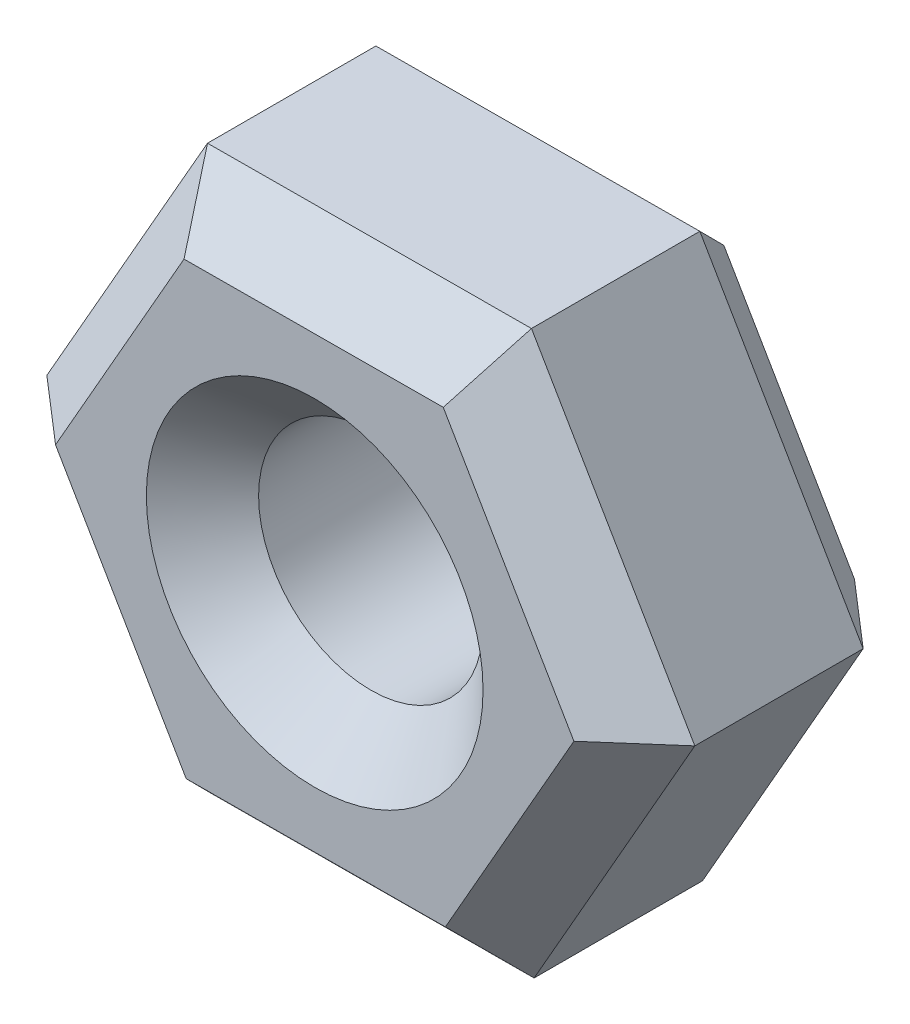
ISO-10303-21;
HEADER;
FILE_DESCRIPTION(('STEP AP214'),'2;1');
FILE_NAME('part.step','',(''),(''),'','','');
FILE_SCHEMA(('AUTOMOTIVE_DESIGN { 1 0 10303 214 1 1 1 1 }'));
ENDSEC;
DATA;
#1=APPLICATION_CONTEXT('core data for automotive mechanical design processes');
#2=APPLICATION_PROTOCOL_DEFINITION('international standard','automotive_design',2000,#1);
#3=PRODUCT_CONTEXT('',#1,'mechanical');
#4=PRODUCT('Part','Part','',(#3));
#5=PRODUCT_RELATED_PRODUCT_CATEGORY('part','',(#4));
#6=PRODUCT_DEFINITION_FORMATION('','',#4);
#7=PRODUCT_DEFINITION_CONTEXT('part definition',#1,'design');
#8=PRODUCT_DEFINITION('design','',#6,#7);
#9=PRODUCT_DEFINITION_SHAPE('','',#8);
#10=(LENGTH_UNIT() NAMED_UNIT(*) SI_UNIT(.MILLI.,.METRE.));
#11=(NAMED_UNIT(*) PLANE_ANGLE_UNIT() SI_UNIT($,.RADIAN.));
#12=(NAMED_UNIT(*) SI_UNIT($,.STERADIAN.) SOLID_ANGLE_UNIT());
#13=UNCERTAINTY_MEASURE_WITH_UNIT(LENGTH_MEASURE(1.E-05),#10,'distance_accuracy_value','');
#14=(GEOMETRIC_REPRESENTATION_CONTEXT(3) GLOBAL_UNCERTAINTY_ASSIGNED_CONTEXT((#13)) GLOBAL_UNIT_ASSIGNED_CONTEXT((#10,
#11,#12)) REPRESENTATION_CONTEXT('',''));
#15=CARTESIAN_POINT('',(0.,0.,0.));
#16=DIRECTION('',(0.,0.,1.));
#17=DIRECTION('',(1.,0.,0.));
#18=AXIS2_PLACEMENT_3D('',#15,#16,#17);
#19=CARTESIAN_POINT('',(0.,0.,5.));
#20=DIRECTION('',(0.,0.,1.));
#21=DIRECTION('',(1.,0.,0.));
#22=AXIS2_PLACEMENT_3D('',#19,#20,#21);
#23=PLANE('',#22);
#24=CARTESIAN_POINT('',(-36.0675441717207,11.9500899364135,5.));
#25=DIRECTION('',(0.,0.,1.));
#26=DIRECTION('',(1.,0.,0.));
#27=AXIS2_PLACEMENT_3D('',#24,#25,#26);
#28=CIRCLE('',#27,3.);
#29=CARTESIAN_POINT('',(-33.0675441717207,11.9500899364135,5.));
#30=VERTEX_POINT('',#29);
#31=EDGE_CURVE('E166',#30,#30,#28,.F.);
#32=ORIENTED_EDGE('',*,*,#31,.T.);
#33=EDGE_LOOP('',(#32));
#34=FACE_BOUND('',#33,.T.);
#35=DIRECTION('',(0.99998873127296,0.00474734948108524,0.));
#36=VECTOR('',#35,1.);
#37=CARTESIAN_POINT('',(-33.1618359578612,7.96383942882583,5.));
#38=LINE('',#37,#36);
#39=CARTESIAN_POINT('',(-38.3579298265445,7.93917147731825,5.));
#40=VERTEX_POINT('',#39);
#41=CARTESIAN_POINT('',(-33.7391797210482,7.96109854532499,5.));
#42=VERTEX_POINT('',#41);
#43=EDGE_CURVE('E163',#40,#42,#38,.T.);
#44=ORIENTED_EDGE('',*,*,#43,.T.);
#45=DIRECTION('',(0.495883040385217,0.868389319521097,0.));
#46=VECTOR('',#45,1.);
#47=CARTESIAN_POINT('',(-31.1624958593714,12.4733818118071,5.));
#48=LINE('',#47,#46);
#49=CARTESIAN_POINT('',(-31.4487940662244,11.9720170044202,5.));
#50=VERTEX_POINT('',#49);
#51=EDGE_CURVE('E143',#42,#50,#48,.T.);
#52=ORIENTED_EDGE('',*,*,#51,.T.);
#53=DIRECTION('',(-0.504105690887743,0.863641970040011,0.));
#54=VECTOR('',#53,1.);
#55=CARTESIAN_POINT('',(-34.068204073231,16.4596323193947,5.));
#56=LINE('',#55,#54);
#57=CARTESIAN_POINT('',(-33.7771585168969,15.9610083955087,5.));
#58=VERTEX_POINT('',#57);
#59=EDGE_CURVE('E152',#50,#58,#56,.T.);
#60=ORIENTED_EDGE('',*,*,#59,.T.);
#61=DIRECTION('',(-0.99998873127296,-0.00474734948108554,0.));
#62=VECTOR('',#61,1.);
#63=CARTESIAN_POINT('',(-38.9732523855802,15.9363404440011,5.));
#64=LINE('',#63,#62);
#65=CARTESIAN_POINT('',(-38.3959086223932,15.9390813275019,5.));
#66=VERTEX_POINT('',#65);
#67=EDGE_CURVE('E159',#58,#66,#64,.T.);
#68=ORIENTED_EDGE('',*,*,#67,.T.);
#69=DIRECTION('',(-0.495883040385216,-0.868389319521097,0.));
#70=VECTOR('',#69,1.);
#71=CARTESIAN_POINT('',(-40.97259248407,11.4267980610198,5.));
#72=LINE('',#71,#70);
#73=CARTESIAN_POINT('',(-40.686294277217,11.9281628684067,5.));
#74=VERTEX_POINT('',#73);
#75=EDGE_CURVE('E310',#66,#74,#72,.T.);
#76=ORIENTED_EDGE('',*,*,#75,.T.);
#77=DIRECTION('',(0.504105690887743,-0.863641970040011,0.));
#78=VECTOR('',#77,1.);
#79=CARTESIAN_POINT('',(-38.0668842702104,7.44054755343219,5.));
#80=LINE('',#79,#78);
#81=EDGE_CURVE('E173',#74,#40,#80,.T.);
#82=ORIENTED_EDGE('',*,*,#81,.T.);
#83=EDGE_LOOP('',(#44,#52,#60,#68,#76,#82));
#84=FACE_BOUND('',#83,.T.);
#85=ADVANCED_FACE('F45',(#34,#84),#23,.T.);
#86=CARTESIAN_POINT('',(0.,0.,0.));
#87=DIRECTION('',(0.,0.,1.));
#88=DIRECTION('',(1.,0.,0.));
#89=AXIS2_PLACEMENT_3D('',#86,#87,#88);
#90=PLANE('',#89);
#91=CARTESIAN_POINT('',(-36.0675441717207,11.9500899364135,0.));
#92=DIRECTION('',(0.,0.,1.));
#93=DIRECTION('',(1.,0.,0.));
#94=AXIS2_PLACEMENT_3D('',#91,#92,#93);
#95=CIRCLE('',#94,3.);
#96=CARTESIAN_POINT('',(-33.0675441717207,11.9500899364135,0.));
#97=VERTEX_POINT('',#96);
#98=EDGE_CURVE('E11',#97,#97,#95,.T.);
#99=ORIENTED_EDGE('',*,*,#98,.T.);
#100=EDGE_LOOP('',(#99));
#101=FACE_BOUND('',#100,.T.);
#102=DIRECTION('',(0.495883040385216,0.868389319521097,0.));
#103=VECTOR('',#102,1.);
#104=CARTESIAN_POINT('',(-35.8180348915737,20.4534482902813,0.));
#105=LINE('',#104,#103);
#106=CARTESIAN_POINT('',(-40.686294277217,11.9281628684067,0.));
#107=VERTEX_POINT('',#106);
#108=CARTESIAN_POINT('',(-38.3959086223932,15.9390813275019,0.));
#109=VERTEX_POINT('',#108);
#110=EDGE_CURVE('E64',#107,#109,#105,.T.);
#111=ORIENTED_EDGE('',*,*,#110,.T.);
#112=DIRECTION('',(0.99998873127296,0.00474734948108554,0.));
#113=VECTOR('',#112,1.);
#114=CARTESIAN_POINT('',(-0.0765328779344243,16.1209988460368,0.));
#115=LINE('',#114,#113);
#116=CARTESIAN_POINT('',(-33.7771585168969,15.9610083955087,0.));
#117=VERTEX_POINT('',#116);
#118=EDGE_CURVE('E56',#109,#117,#115,.T.);
#119=ORIENTED_EDGE('',*,*,#118,.T.);
#120=DIRECTION('',(0.504105690887743,-0.863641970040011,0.));
#121=VECTOR('',#120,1.);
#122=CARTESIAN_POINT('',(-18.2447272839216,-10.6494023815143,0.));
#123=LINE('',#122,#121);
#124=CARTESIAN_POINT('',(-31.4487940662244,11.9720170044202,0.));
#125=VERTEX_POINT('',#124);
#126=EDGE_CURVE('E212',#117,#125,#123,.T.);
#127=ORIENTED_EDGE('',*,*,#126,.T.);
#128=DIRECTION('',(-0.495883040385217,-0.868389319521097,0.));
#129=VECTOR('',#128,1.);
#130=CARTESIAN_POINT('',(-28.8709203354049,16.4863839671996,0.));
#131=LINE('',#130,#129);
#132=CARTESIAN_POINT('',(-33.7391797210482,7.96109854532498,0.));
#133=VERTEX_POINT('',#132);
#134=EDGE_CURVE('E215',#125,#133,#131,.T.);
#135=ORIENTED_EDGE('',*,*,#134,.T.);
#136=DIRECTION('',(-0.99998873127296,-0.00474734948108524,0.));
#137=VECTOR('',#136,1.);
#138=CARTESIAN_POINT('',(-0.0385540820857374,8.12108899585307,0.));
#139=LINE('',#138,#137);
#140=CARTESIAN_POINT('',(-38.3579298265445,7.93917147731825,0.));
#141=VERTEX_POINT('',#140);
#142=EDGE_CURVE('E218',#133,#141,#139,.T.);
#143=ORIENTED_EDGE('',*,*,#142,.T.);
#144=DIRECTION('',(-0.504105690887743,0.863641970040011,0.));
#145=VECTOR('',#144,1.);
#146=CARTESIAN_POINT('',(-25.1538630442417,-14.6822479086162,0.));
#147=LINE('',#146,#145);
#148=EDGE_CURVE('E69',#141,#107,#147,.T.);
#149=ORIENTED_EDGE('',*,*,#148,.T.);
#150=EDGE_LOOP('',(#111,#119,#127,#135,#143,#149));
#151=FACE_BOUND('',#150,.T.);
#152=ADVANCED_FACE('F274',(#101,#151),#90,.F.);
#153=CARTESIAN_POINT('',(-30.2941065398503,11.9774987714219,5.));
#154=DIRECTION('',(-0.863641970040011,-0.504105690887743,0.));
#155=DIRECTION('',(0.504105690887743,-0.863641970040011,0.));
#156=AXIS2_PLACEMENT_3D('',#153,#154,#155);
#157=PLANE('',#156);
#158=DIRECTION('',(0.,0.,-1.));
#159=VECTOR('',#158,1.);
#160=CARTESIAN_POINT('',(-33.204562103191,16.9637380102825,5.));
#161=LINE('',#160,#159);
#162=CARTESIAN_POINT('',(-33.204562103191,16.9637380102825,4.));
#163=VERTEX_POINT('',#162);
#164=CARTESIAN_POINT('',(-33.204562103191,16.9637380102825,0.999999999999999));
#165=VERTEX_POINT('',#164);
#166=EDGE_CURVE('E286',#163,#165,#161,.T.);
#167=ORIENTED_EDGE('',*,*,#166,.F.);
#168=DIRECTION('',(0.504105690887743,-0.863641970040011,0.));
#169=VECTOR('',#168,1.);
#170=CARTESIAN_POINT('',(-30.2941065398503,11.9774987714219,4.));
#171=LINE('',#170,#169);
#172=CARTESIAN_POINT('',(-30.2941065398503,11.9774987714219,4.));
#173=VERTEX_POINT('',#172);
#174=EDGE_CURVE('E209',#163,#173,#171,.T.);
#175=ORIENTED_EDGE('',*,*,#174,.T.);
#176=DIRECTION('',(0.,0.,-1.));
#177=VECTOR('',#176,1.);
#178=CARTESIAN_POINT('',(-30.2941065398503,11.9774987714219,5.));
#179=LINE('',#178,#177);
#180=CARTESIAN_POINT('',(-30.2941065398503,11.9774987714219,0.999999999999999));
#181=VERTEX_POINT('',#180);
#182=EDGE_CURVE('E243',#173,#181,#179,.T.);
#183=ORIENTED_EDGE('',*,*,#182,.T.);
#184=DIRECTION('',(-0.504105690887743,0.863641970040011,0.));
#185=VECTOR('',#184,1.);
#186=CARTESIAN_POINT('',(-30.2941065398503,11.9774987714219,0.999999999999999));
#187=LINE('',#186,#185);
#188=EDGE_CURVE('E206',#181,#165,#187,.T.);
#189=ORIENTED_EDGE('',*,*,#188,.T.);
#190=EDGE_LOOP('',(#167,#175,#183,#189));
#191=FACE_BOUND('',#190,.T.);
#192=ADVANCED_FACE('F285',(#191),#157,.F.);
#193=CARTESIAN_POINT('',(-33.204562103191,16.9637380102825,5.));
#194=DIRECTION('',(0.00474734948108554,-0.99998873127296,0.));
#195=DIRECTION('',(0.99998873127296,0.00474734948108554,0.));
#196=AXIS2_PLACEMENT_3D('',#193,#194,#195);
#197=PLANE('',#196);
#198=DIRECTION('',(0.,0.,-1.));
#199=VECTOR('',#198,1.);
#200=CARTESIAN_POINT('',(-38.9779997350613,16.9363291752741,5.));
#201=LINE('',#200,#199);
#202=CARTESIAN_POINT('',(-38.9779997350613,16.9363291752741,4.));
#203=VERTEX_POINT('',#202);
#204=CARTESIAN_POINT('',(-38.9779997350613,16.9363291752741,0.999999999999999));
#205=VERTEX_POINT('',#204);
#206=EDGE_CURVE('E295',#203,#205,#201,.T.);
#207=ORIENTED_EDGE('',*,*,#206,.F.);
#208=DIRECTION('',(0.99998873127296,0.00474734948108554,0.));
#209=VECTOR('',#208,1.);
#210=CARTESIAN_POINT('',(-33.204562103191,16.9637380102825,4.));
#211=LINE('',#210,#209);
#212=EDGE_CURVE('E203',#203,#163,#211,.T.);
#213=ORIENTED_EDGE('',*,*,#212,.T.);
#214=ORIENTED_EDGE('',*,*,#166,.T.);
#215=DIRECTION('',(-0.99998873127296,-0.00474734948108554,0.));
#216=VECTOR('',#215,1.);
#217=CARTESIAN_POINT('',(-33.204562103191,16.9637380102825,0.999999999999999));
#218=LINE('',#217,#216);
#219=EDGE_CURVE('E199',#165,#205,#218,.T.);
#220=ORIENTED_EDGE('',*,*,#219,.T.);
#221=EDGE_LOOP('',(#207,#213,#214,#220));
#222=FACE_BOUND('',#221,.T.);
#223=ADVANCED_FACE('F290',(#222),#197,.F.);
#224=CARTESIAN_POINT('',(-38.9779997350613,16.9363291752741,5.));
#225=DIRECTION('',(0.868389319521097,-0.495883040385216,0.));
#226=DIRECTION('',(0.495883040385216,0.868389319521097,0.));
#227=AXIS2_PLACEMENT_3D('',#224,#225,#226);
#228=PLANE('',#227);
#229=DIRECTION('',(0.,0.,-1.));
#230=VECTOR('',#229,1.);
#231=CARTESIAN_POINT('',(-41.8409818035911,11.922681101405,5.));
#232=LINE('',#231,#230);
#233=CARTESIAN_POINT('',(-41.8409818035911,11.922681101405,4.));
#234=VERTEX_POINT('',#233);
#235=CARTESIAN_POINT('',(-41.8409818035911,11.922681101405,0.999999999999999));
#236=VERTEX_POINT('',#235);
#237=EDGE_CURVE('E301',#234,#236,#232,.T.);
#238=ORIENTED_EDGE('',*,*,#237,.F.);
#239=DIRECTION('',(0.495883040385216,0.868389319521097,0.));
#240=VECTOR('',#239,1.);
#241=CARTESIAN_POINT('',(-38.9779997350613,16.9363291752741,4.));
#242=LINE('',#241,#240);
#243=EDGE_CURVE('E196',#234,#203,#242,.T.);
#244=ORIENTED_EDGE('',*,*,#243,.T.);
#245=ORIENTED_EDGE('',*,*,#206,.T.);
#246=DIRECTION('',(-0.495883040385216,-0.868389319521097,0.));
#247=VECTOR('',#246,1.);
#248=CARTESIAN_POINT('',(-38.9779997350613,16.9363291752741,0.999999999999999));
#249=LINE('',#248,#247);
#250=EDGE_CURVE('E193',#205,#236,#249,.T.);
#251=ORIENTED_EDGE('',*,*,#250,.T.);
#252=EDGE_LOOP('',(#238,#244,#245,#251));
#253=FACE_BOUND('',#252,.T.);
#254=ADVANCED_FACE('F378',(#253),#228,.F.);
#255=CARTESIAN_POINT('',(-41.8409818035911,11.922681101405,5.));
#256=DIRECTION('',(0.863641970040011,0.504105690887743,0.));
#257=DIRECTION('',(-0.504105690887743,0.863641970040011,0.));
#258=AXIS2_PLACEMENT_3D('',#255,#256,#257);
#259=PLANE('',#258);
#260=DIRECTION('',(0.,0.,-1.));
#261=VECTOR('',#260,1.);
#262=CARTESIAN_POINT('',(-38.9305262402504,6.93644186254445,5.));
#263=LINE('',#262,#261);
#264=CARTESIAN_POINT('',(-38.9305262402504,6.93644186254445,4.));
#265=VERTEX_POINT('',#264);
#266=CARTESIAN_POINT('',(-38.9305262402504,6.93644186254445,0.999999999999999));
#267=VERTEX_POINT('',#266);
#268=EDGE_CURVE('E333',#265,#267,#263,.T.);
#269=ORIENTED_EDGE('',*,*,#268,.F.);
#270=DIRECTION('',(-0.504105690887743,0.863641970040011,0.));
#271=VECTOR('',#270,1.);
#272=CARTESIAN_POINT('',(-41.8409818035911,11.922681101405,4.));
#273=LINE('',#272,#271);
#274=EDGE_CURVE('E190',#265,#234,#273,.T.);
#275=ORIENTED_EDGE('',*,*,#274,.T.);
#276=ORIENTED_EDGE('',*,*,#237,.T.);
#277=DIRECTION('',(0.504105690887743,-0.863641970040011,0.));
#278=VECTOR('',#277,1.);
#279=CARTESIAN_POINT('',(-41.8409818035911,11.922681101405,0.999999999999999));
#280=LINE('',#279,#278);
#281=EDGE_CURVE('E187',#236,#267,#280,.T.);
#282=ORIENTED_EDGE('',*,*,#281,.T.);
#283=EDGE_LOOP('',(#269,#275,#276,#282));
#284=FACE_BOUND('',#283,.T.);
#285=ADVANCED_FACE('F343',(#284),#259,.F.);
#286=CARTESIAN_POINT('',(-38.9305262402504,6.93644186254445,5.));
#287=DIRECTION('',(-0.00474734948108524,0.99998873127296,0.));
#288=DIRECTION('',(-0.99998873127296,-0.00474734948108524,0.));
#289=AXIS2_PLACEMENT_3D('',#286,#287,#288);
#290=PLANE('',#289);
#291=DIRECTION('',(0.,0.,-1.));
#292=VECTOR('',#291,1.);
#293=CARTESIAN_POINT('',(-33.1570886083801,6.96385069755287,5.));
#294=LINE('',#293,#292);
#295=CARTESIAN_POINT('',(-33.1570886083801,6.96385069755287,4.));
#296=VERTEX_POINT('',#295);
#297=CARTESIAN_POINT('',(-33.1570886083801,6.96385069755287,0.999999999999999));
#298=VERTEX_POINT('',#297);
#299=EDGE_CURVE('E330',#296,#298,#294,.T.);
#300=ORIENTED_EDGE('',*,*,#299,.F.);
#301=DIRECTION('',(-0.99998873127296,-0.00474734948108524,0.));
#302=VECTOR('',#301,1.);
#303=CARTESIAN_POINT('',(-38.9305262402504,6.93644186254445,4.));
#304=LINE('',#303,#302);
#305=EDGE_CURVE('E184',#296,#265,#304,.T.);
#306=ORIENTED_EDGE('',*,*,#305,.T.);
#307=ORIENTED_EDGE('',*,*,#268,.T.);
#308=DIRECTION('',(0.99998873127296,0.00474734948108524,0.));
#309=VECTOR('',#308,1.);
#310=CARTESIAN_POINT('',(-38.9305262402504,6.93644186254445,0.999999999999999));
#311=LINE('',#310,#309);
#312=EDGE_CURVE('E181',#267,#298,#311,.T.);
#313=ORIENTED_EDGE('',*,*,#312,.T.);
#314=EDGE_LOOP('',(#300,#306,#307,#313));
#315=FACE_BOUND('',#314,.T.);
#316=ADVANCED_FACE('F331',(#315),#290,.F.);
#317=CARTESIAN_POINT('',(-33.1570886083801,6.96385069755287,5.));
#318=DIRECTION('',(-0.868389319521097,0.495883040385217,0.));
#319=DIRECTION('',(-0.495883040385217,-0.868389319521097,0.));
#320=AXIS2_PLACEMENT_3D('',#317,#318,#319);
#321=PLANE('',#320);
#322=ORIENTED_EDGE('',*,*,#182,.F.);
#323=DIRECTION('',(-0.495883040385217,-0.868389319521097,0.));
#324=VECTOR('',#323,1.);
#325=CARTESIAN_POINT('',(-33.1570886083801,6.96385069755287,4.));
#326=LINE('',#325,#324);
#327=EDGE_CURVE('E145',#173,#296,#326,.T.);
#328=ORIENTED_EDGE('',*,*,#327,.T.);
#329=ORIENTED_EDGE('',*,*,#299,.T.);
#330=DIRECTION('',(0.495883040385217,0.868389319521097,0.));
#331=VECTOR('',#330,1.);
#332=CARTESIAN_POINT('',(-33.1570886083801,6.96385069755287,0.999999999999999));
#333=LINE('',#332,#331);
#334=EDGE_CURVE('E171',#298,#181,#333,.T.);
#335=ORIENTED_EDGE('',*,*,#334,.T.);
#336=EDGE_LOOP('',(#322,#328,#329,#335));
#337=FACE_BOUND('',#336,.T.);
#338=ADVANCED_FACE('F329',(#337),#321,.F.);
#339=CARTESIAN_POINT('',(-36.0675441717207,11.9500899364135,5.));
#340=DIRECTION('',(0.,0.,-1.));
#341=DIRECTION('',(-1.,0.,0.));
#342=AXIS2_PLACEMENT_3D('',#339,#340,#341);
#343=CYLINDRICAL_SURFACE('',#342,2.);
#344=CARTESIAN_POINT('',(-36.0675441717207,11.9500899364135,4.));
#345=DIRECTION('',(0.,0.,1.));
#346=DIRECTION('',(1.,0.,0.));
#347=AXIS2_PLACEMENT_3D('',#344,#345,#346);
#348=CIRCLE('',#347,2.);
#349=CARTESIAN_POINT('',(-34.0675441717207,11.9500899364135,4.));
#350=VERTEX_POINT('',#349);
#351=EDGE_CURVE('E160',#350,#350,#348,.T.);
#352=ORIENTED_EDGE('',*,*,#351,.T.);
#353=EDGE_LOOP('',(#352));
#354=FACE_BOUND('',#353,.T.);
#355=CARTESIAN_POINT('',(-36.0675441717207,11.9500899364135,1.));
#356=DIRECTION('',(0.,0.,1.));
#357=DIRECTION('',(1.,0.,0.));
#358=AXIS2_PLACEMENT_3D('',#355,#356,#357);
#359=CIRCLE('',#358,2.);
#360=CARTESIAN_POINT('',(-34.0675441717207,11.9500899364135,1.));
#361=VERTEX_POINT('',#360);
#362=EDGE_CURVE('E294',#361,#361,#359,.F.);
#363=ORIENTED_EDGE('',*,*,#362,.T.);
#364=EDGE_LOOP('',(#363));
#365=FACE_BOUND('',#364,.T.);
#366=ADVANCED_FACE('F370',(#354,#365),#343,.F.);
#367=CARTESIAN_POINT('',(-36.0675441717207,11.9500899364135,4.));
#368=DIRECTION('',(0.,0.,1.));
#369=DIRECTION('',(1.,0.,0.));
#370=AXIS2_PLACEMENT_3D('',#367,#368,#369);
#371=CONICAL_SURFACE('',#370,2.,0.78539816339745);
#372=ORIENTED_EDGE('',*,*,#31,.F.);
#373=EDGE_LOOP('',(#372));
#374=FACE_BOUND('',#373,.T.);
#375=ORIENTED_EDGE('',*,*,#351,.F.);
#376=EDGE_LOOP('',(#375));
#377=FACE_BOUND('',#376,.T.);
#378=ADVANCED_FACE('F386',(#374,#377),#371,.F.);
#379=CARTESIAN_POINT('',(-35.8180348915737,20.4534482902813,5.));
#380=DIRECTION('',(-0.614043976543338,0.350642260531789,0.707106781186548));
#381=DIRECTION('',(0.495883040385216,0.868389319521097,0.));
#382=AXIS2_PLACEMENT_3D('',#379,#380,#381);
#383=PLANE('',#382);
#384=DIRECTION('',(0.38106808359468,-0.652851964149645,0.654653670707977));
#385=VECTOR('',#384,1.);
#386=CARTESIAN_POINT('',(-32.8766991753434,6.48348301533186,14.4816933757182));
#387=LINE('',#386,#385);
#388=EDGE_CURVE('E235',#203,#66,#387,.T.);
#389=ORIENTED_EDGE('',*,*,#388,.F.);
#390=ORIENTED_EDGE('',*,*,#243,.F.);
#391=DIRECTION('',(0.755920427661501,0.00358865888961803,0.654653670707976));
#392=VECTOR('',#391,1.);
#393=CARTESIAN_POINT('',(-37.8813675793089,11.9414789857662,7.42916514974057));
#394=LINE('',#393,#392);
#395=EDGE_CURVE('E239',#74,#234,#394,.F.);
#396=ORIENTED_EDGE('',*,*,#395,.F.);
#397=ORIENTED_EDGE('',*,*,#75,.F.);
#398=EDGE_LOOP('',(#389,#390,#396,#397));
#399=FACE_BOUND('',#398,.T.);
#400=ADVANCED_FACE('F392',(#399),#383,.T.);
#401=CARTESIAN_POINT('',(-25.1538630442417,-14.6822479086162,5.));
#402=DIRECTION('',(-0.6106870935326,-0.356456552461453,0.707106781186548));
#403=DIRECTION('',(-0.504105690887743,0.863641970040011,0.));
#404=AXIS2_PLACEMENT_3D('',#401,#402,#403);
#405=PLANE('',#404);
#406=ORIENTED_EDGE('',*,*,#395,.T.);
#407=ORIENTED_EDGE('',*,*,#274,.F.);
#408=DIRECTION('',(0.374852344066824,0.656440623039266,0.654653670707977));
#409=VECTOR('',#408,1.);
#410=CARTESIAN_POINT('',(-42.0689842456101,1.44038091740176,-1.48109965454894));
#411=LINE('',#410,#409);
#412=EDGE_CURVE('E231',#40,#265,#411,.F.);
#413=ORIENTED_EDGE('',*,*,#412,.F.);
#414=ORIENTED_EDGE('',*,*,#81,.F.);
#415=EDGE_LOOP('',(#406,#407,#413,#414));
#416=FACE_BOUND('',#415,.T.);
#417=ADVANCED_FACE('F319',(#416),#405,.T.);
#418=CARTESIAN_POINT('',(-0.0765328779344243,16.1209988460368,5.));
#419=DIRECTION('',(-0.00335688301073803,0.707098812993244,0.707106781186546));
#420=DIRECTION('',(0.99998873127296,0.00474734948108554,0.));
#421=AXIS2_PLACEMENT_3D('',#418,#419,#420);
#422=PLANE('',#421);
#423=ORIENTED_EDGE('',*,*,#388,.T.);
#424=ORIENTED_EDGE('',*,*,#67,.F.);
#425=DIRECTION('',(-0.374852344066826,-0.656440623039264,0.654653670707978));
#426=VECTOR('',#425,1.);
#427=CARTESIAN_POINT('',(-38.1426088373407,8.31624113299364,12.623956797406));
#428=LINE('',#427,#426);
#429=EDGE_CURVE('E155',#163,#58,#428,.T.);
#430=ORIENTED_EDGE('',*,*,#429,.F.);
#431=ORIENTED_EDGE('',*,*,#212,.F.);
#432=EDGE_LOOP('',(#423,#424,#430,#431));
#433=FACE_BOUND('',#432,.T.);
#434=ADVANCED_FACE('F412',(#433),#422,.T.);
#435=CARTESIAN_POINT('',(-0.0385540820857375,8.12108899585308,5.));
#436=DIRECTION('',(0.00335688301073781,-0.707098812993242,0.707106781186548));
#437=DIRECTION('',(-0.99998873127296,-0.00474734948108524,0.));
#438=AXIS2_PLACEMENT_3D('',#435,#436,#437);
#439=PLANE('',#438);
#440=ORIENTED_EDGE('',*,*,#412,.T.);
#441=ORIENTED_EDGE('',*,*,#305,.F.);
#442=DIRECTION('',(-0.381068083594678,0.652851964149647,0.654653670707976));
#443=VECTOR('',#442,1.);
#444=CARTESIAN_POINT('',(-28.8852172599049,-0.354787940819815,-3.338836232861));
#445=LINE('',#444,#443);
#446=EDGE_CURVE('E149',#42,#296,#445,.F.);
#447=ORIENTED_EDGE('',*,*,#446,.F.);
#448=ORIENTED_EDGE('',*,*,#43,.F.);
#449=EDGE_LOOP('',(#440,#441,#447,#448));
#450=FACE_BOUND('',#449,.T.);
#451=ADVANCED_FACE('F322',(#450),#439,.T.);
#452=CARTESIAN_POINT('',(-18.2447272839216,-10.6494023815143,5.));
#453=DIRECTION('',(0.6106870935326,0.356456552461453,0.707106781186548));
#454=DIRECTION('',(0.504105690887743,-0.863641970040011,0.));
#455=AXIS2_PLACEMENT_3D('',#452,#453,#454);
#456=PLANE('',#455);
#457=ORIENTED_EDGE('',*,*,#429,.T.);
#458=ORIENTED_EDGE('',*,*,#59,.F.);
#459=DIRECTION('',(0.755920427661501,0.00358865888961654,-0.654653670707976));
#460=VECTOR('',#459,1.);
#461=CARTESIAN_POINT('',(-23.9651491379294,12.0075448826411,-1.48109965454898));
#462=LINE('',#461,#460);
#463=EDGE_CURVE('E139',#173,#50,#462,.F.);
#464=ORIENTED_EDGE('',*,*,#463,.F.);
#465=ORIENTED_EDGE('',*,*,#174,.F.);
#466=EDGE_LOOP('',(#457,#458,#464,#465));
#467=FACE_BOUND('',#466,.T.);
#468=ADVANCED_FACE('F153',(#467),#456,.T.);
#469=CARTESIAN_POINT('',(-28.8709203354049,16.4863839671996,5.));
#470=DIRECTION('',(0.614043976543338,-0.350642260531789,0.707106781186549));
#471=DIRECTION('',(-0.495883040385217,-0.868389319521097,0.));
#472=AXIS2_PLACEMENT_3D('',#469,#470,#471);
#473=PLANE('',#472);
#474=ORIENTED_EDGE('',*,*,#446,.T.);
#475=ORIENTED_EDGE('',*,*,#327,.F.);
#476=ORIENTED_EDGE('',*,*,#463,.T.);
#477=ORIENTED_EDGE('',*,*,#51,.F.);
#478=EDGE_LOOP('',(#474,#475,#476,#477));
#479=FACE_BOUND('',#478,.T.);
#480=ADVANCED_FACE('F141',(#479),#473,.T.);
#481=CARTESIAN_POINT('',(-36.0675441717207,11.9500899364135,0.));
#482=DIRECTION('',(0.,0.,-1.));
#483=DIRECTION('',(-1.,0.,0.));
#484=AXIS2_PLACEMENT_3D('',#481,#482,#483);
#485=CONICAL_SURFACE('',#484,3.,0.785398163397443);
#486=ORIENTED_EDGE('',*,*,#362,.F.);
#487=EDGE_LOOP('',(#486));
#488=FACE_BOUND('',#487,.T.);
#489=ORIENTED_EDGE('',*,*,#98,.F.);
#490=EDGE_LOOP('',(#489));
#491=FACE_BOUND('',#490,.T.);
#492=ADVANCED_FACE('F401',(#488,#491),#485,.F.);
#493=CARTESIAN_POINT('',(-38.9305262402504,6.93644186254445,0.999999999999999));
#494=DIRECTION('',(-0.00335688301073782,0.707098812993244,0.707106781186546));
#495=DIRECTION('',(0.99998873127296,0.00474734948108524,0.));
#496=AXIS2_PLACEMENT_3D('',#493,#494,#495);
#497=PLANE('',#496);
#498=DIRECTION('',(0.374852344066817,0.656440623039266,-0.654653670707981));
#499=VECTOR('',#498,1.);
#500=CARTESIAN_POINT('',(-38.9305262402504,6.93644186254445,0.999999999999999));
#501=LINE('',#500,#499);
#502=EDGE_CURVE('E257',#141,#267,#501,.F.);
#503=ORIENTED_EDGE('',*,*,#502,.F.);
#504=ORIENTED_EDGE('',*,*,#142,.F.);
#505=DIRECTION('',(-0.381068083594682,0.652851964149644,-0.654653670707977));
#506=VECTOR('',#505,1.);
#507=CARTESIAN_POINT('',(-33.1570886083801,6.96385069755287,0.999999999999999));
#508=LINE('',#507,#506);
#509=EDGE_CURVE('E50',#298,#133,#508,.T.);
#510=ORIENTED_EDGE('',*,*,#509,.F.);
#511=ORIENTED_EDGE('',*,*,#312,.F.);
#512=EDGE_LOOP('',(#503,#504,#510,#511));
#513=FACE_BOUND('',#512,.T.);
#514=ADVANCED_FACE('F48',(#513),#497,.F.);
#515=CARTESIAN_POINT('',(-33.1570886083801,6.96385069755287,0.999999999999999));
#516=DIRECTION('',(-0.614043976543338,0.350642260531789,0.707106781186549));
#517=DIRECTION('',(0.495883040385217,0.868389319521097,0.));
#518=AXIS2_PLACEMENT_3D('',#515,#516,#517);
#519=PLANE('',#518);
#520=ORIENTED_EDGE('',*,*,#509,.T.);
#521=ORIENTED_EDGE('',*,*,#134,.F.);
#522=DIRECTION('',(-0.7559204276615,-0.00358865888961327,-0.654653670707977));
#523=VECTOR('',#522,1.);
#524=CARTESIAN_POINT('',(-30.2941065398503,11.9774987714219,0.999999999999999));
#525=LINE('',#524,#523);
#526=EDGE_CURVE('E254',#181,#125,#525,.T.);
#527=ORIENTED_EDGE('',*,*,#526,.F.);
#528=ORIENTED_EDGE('',*,*,#334,.F.);
#529=EDGE_LOOP('',(#520,#521,#527,#528));
#530=FACE_BOUND('',#529,.T.);
#531=ADVANCED_FACE('F269',(#530),#519,.F.);
#532=CARTESIAN_POINT('',(-41.8409818035911,11.922681101405,0.999999999999999));
#533=DIRECTION('',(0.610687093532605,0.356456552461455,0.707106781186543));
#534=DIRECTION('',(0.504105690887743,-0.863641970040011,0.));
#535=AXIS2_PLACEMENT_3D('',#532,#533,#534);
#536=PLANE('',#535);
#537=ORIENTED_EDGE('',*,*,#502,.T.);
#538=ORIENTED_EDGE('',*,*,#281,.F.);
#539=DIRECTION('',(0.755920427661498,0.00358865888960774,-0.654653670707979));
#540=VECTOR('',#539,1.);
#541=CARTESIAN_POINT('',(-41.8409818035911,11.922681101405,0.999999999999999));
#542=LINE('',#541,#540);
#543=EDGE_CURVE('E250',#107,#236,#542,.F.);
#544=ORIENTED_EDGE('',*,*,#543,.F.);
#545=ORIENTED_EDGE('',*,*,#148,.F.);
#546=EDGE_LOOP('',(#537,#538,#544,#545));
#547=FACE_BOUND('',#546,.T.);
#548=ADVANCED_FACE('F346',(#547),#536,.F.);
#549=CARTESIAN_POINT('',(-30.2941065398503,11.9774987714219,0.999999999999999));
#550=DIRECTION('',(-0.610687093532602,-0.356456552461454,0.707106781186546));
#551=DIRECTION('',(-0.504105690887743,0.863641970040011,0.));
#552=AXIS2_PLACEMENT_3D('',#549,#550,#551);
#553=PLANE('',#552);
#554=ORIENTED_EDGE('',*,*,#526,.T.);
#555=ORIENTED_EDGE('',*,*,#126,.F.);
#556=DIRECTION('',(0.374852344066823,0.656440623039264,0.654653670707978));
#557=VECTOR('',#556,1.);
#558=CARTESIAN_POINT('',(-34.0225569799137,15.5312671320342,-0.428571428571432));
#559=LINE('',#558,#557);
#560=EDGE_CURVE('E247',#165,#117,#559,.F.);
#561=ORIENTED_EDGE('',*,*,#560,.F.);
#562=ORIENTED_EDGE('',*,*,#188,.F.);
#563=EDGE_LOOP('',(#554,#555,#561,#562));
#564=FACE_BOUND('',#563,.T.);
#565=ADVANCED_FACE('F278',(#564),#553,.F.);
#566=CARTESIAN_POINT('',(-38.9779997350613,16.9363291752741,0.999999999999999));
#567=DIRECTION('',(0.614043976543338,-0.350642260531789,0.707106781186548));
#568=DIRECTION('',(-0.495883040385216,-0.868389319521097,0.));
#569=AXIS2_PLACEMENT_3D('',#566,#567,#568);
#570=PLANE('',#569);
#571=ORIENTED_EDGE('',*,*,#543,.T.);
#572=ORIENTED_EDGE('',*,*,#250,.F.);
#573=DIRECTION('',(0.38106808359468,-0.652851964149645,-0.654653670707977));
#574=VECTOR('',#573,1.);
#575=CARTESIAN_POINT('',(-38.9779997350613,16.9363291752741,0.999999999999999));
#576=LINE('',#575,#574);
#577=EDGE_CURVE('E244',#109,#205,#576,.F.);
#578=ORIENTED_EDGE('',*,*,#577,.F.);
#579=ORIENTED_EDGE('',*,*,#110,.F.);
#580=EDGE_LOOP('',(#571,#572,#578,#579));
#581=FACE_BOUND('',#580,.T.);
#582=ADVANCED_FACE('F349',(#581),#570,.F.);
#583=CARTESIAN_POINT('',(-33.204562103191,16.9637380102825,0.999999999999999));
#584=DIRECTION('',(0.00335688301073803,-0.707098812993244,0.707106781186546));
#585=DIRECTION('',(-0.99998873127296,-0.00474734948108554,0.));
#586=AXIS2_PLACEMENT_3D('',#583,#584,#585);
#587=PLANE('',#586);
#588=ORIENTED_EDGE('',*,*,#560,.T.);
#589=ORIENTED_EDGE('',*,*,#118,.F.);
#590=ORIENTED_EDGE('',*,*,#577,.T.);
#591=ORIENTED_EDGE('',*,*,#219,.F.);
#592=EDGE_LOOP('',(#588,#589,#590,#591));
#593=FACE_BOUND('',#592,.T.);
#594=ADVANCED_FACE('F352',(#593),#587,.F.);
#595=CLOSED_SHELL('',(#85,#152,#192,#223,#254,#285,#316,#338,#366,#378,#400,#417,#434,#451,#468,
#480,#492,#514,#531,#548,#565,#582,#594));
#596=MANIFOLD_SOLID_BREP('B2',#595);
#597=ADVANCED_BREP_SHAPE_REPRESENTATION('',(#18,#596),#14);
#598=SHAPE_DEFINITION_REPRESENTATION(#9,#597);
ENDSEC;
END-ISO-10303-21;
